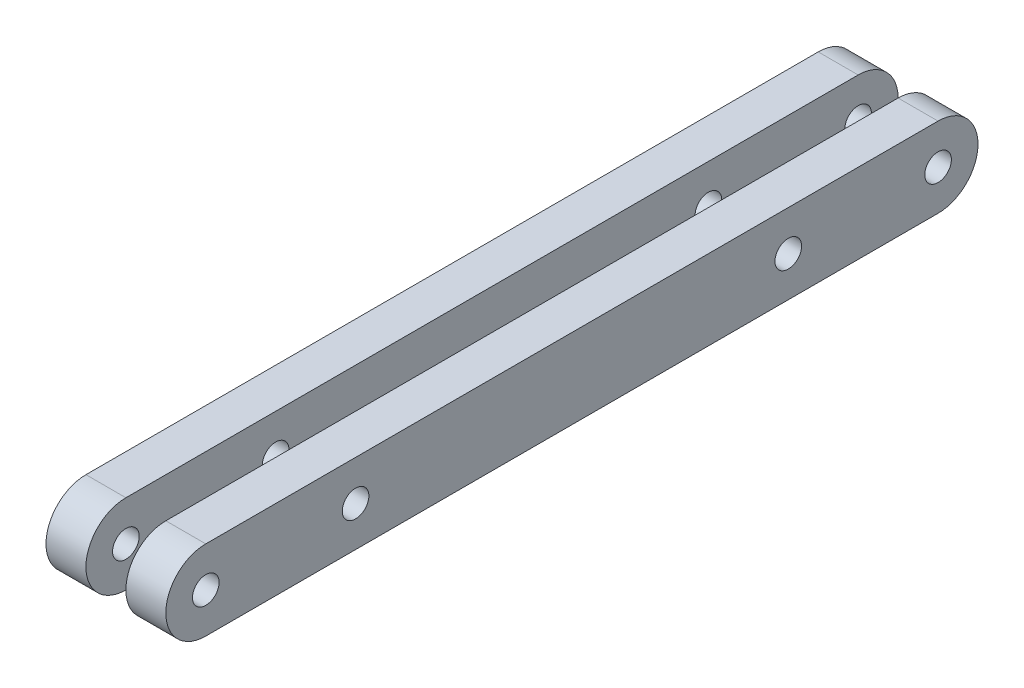
ISO-10303-21;
HEADER;
FILE_DESCRIPTION(('STEP AP214'),'2;1');
FILE_NAME('part.step','',(''),(''),'','','');
FILE_SCHEMA(('AUTOMOTIVE_DESIGN { 1 0 10303 214 1 1 1 1 }'));
ENDSEC;
DATA;
#1=APPLICATION_CONTEXT('core data for automotive mechanical design processes');
#2=APPLICATION_PROTOCOL_DEFINITION('international standard','automotive_design',2000,#1);
#3=PRODUCT_CONTEXT('',#1,'mechanical');
#4=PRODUCT('Part','Part','',(#3));
#5=PRODUCT_RELATED_PRODUCT_CATEGORY('part','',(#4));
#6=PRODUCT_DEFINITION_FORMATION('','',#4);
#7=PRODUCT_DEFINITION_CONTEXT('part definition',#1,'design');
#8=PRODUCT_DEFINITION('design','',#6,#7);
#9=PRODUCT_DEFINITION_SHAPE('','',#8);
#10=(LENGTH_UNIT() NAMED_UNIT(*) SI_UNIT(.MILLI.,.METRE.));
#11=(NAMED_UNIT(*) PLANE_ANGLE_UNIT() SI_UNIT($,.RADIAN.));
#12=(NAMED_UNIT(*) SI_UNIT($,.STERADIAN.) SOLID_ANGLE_UNIT());
#13=UNCERTAINTY_MEASURE_WITH_UNIT(LENGTH_MEASURE(1.E-05),#10,'distance_accuracy_value','');
#14=(GEOMETRIC_REPRESENTATION_CONTEXT(3) GLOBAL_UNCERTAINTY_ASSIGNED_CONTEXT((#13)) GLOBAL_UNIT_ASSIGNED_CONTEXT((#10,
#11,#12)) REPRESENTATION_CONTEXT('',''));
#15=CARTESIAN_POINT('',(0.,0.,0.));
#16=DIRECTION('',(0.,0.,1.));
#17=DIRECTION('',(1.,0.,0.));
#18=AXIS2_PLACEMENT_3D('',#15,#16,#17);
#19=CARTESIAN_POINT('',(-9.,0.,0.));
#20=DIRECTION('',(1.,0.,0.));
#21=DIRECTION('',(0.,0.,1.));
#22=AXIS2_PLACEMENT_3D('',#19,#20,#21);
#23=CYLINDRICAL_SURFACE('',#22,6.);
#24=CARTESIAN_POINT('',(-3.,0.,0.));
#25=DIRECTION('',(1.,0.,0.));
#26=DIRECTION('',(0.,0.,-1.));
#27=AXIS2_PLACEMENT_3D('',#24,#25,#26);
#28=CIRCLE('',#27,6.);
#29=CARTESIAN_POINT('',(-3.,6.,0.));
#30=VERTEX_POINT('',#29);
#31=CARTESIAN_POINT('',(-3.,-6.,0.));
#32=VERTEX_POINT('',#31);
#33=EDGE_CURVE('E113',#30,#32,#28,.T.);
#34=ORIENTED_EDGE('',*,*,#33,.F.);
#35=DIRECTION('',(1.,0.,0.));
#36=VECTOR('',#35,1.);
#37=CARTESIAN_POINT('',(-9.,6.,0.));
#38=LINE('',#37,#36);
#39=CARTESIAN_POINT('',(-9.,6.,0.));
#40=VERTEX_POINT('',#39);
#41=EDGE_CURVE('E112',#40,#30,#38,.T.);
#42=ORIENTED_EDGE('',*,*,#41,.F.);
#43=CARTESIAN_POINT('',(-9.,0.,0.));
#44=DIRECTION('',(1.,0.,0.));
#45=DIRECTION('',(0.,0.,-1.));
#46=AXIS2_PLACEMENT_3D('',#43,#44,#45);
#47=CIRCLE('',#46,6.);
#48=CARTESIAN_POINT('',(-9.,-6.,0.));
#49=VERTEX_POINT('',#48);
#50=EDGE_CURVE('E106',#40,#49,#47,.T.);
#51=ORIENTED_EDGE('',*,*,#50,.T.);
#52=DIRECTION('',(1.,0.,0.));
#53=VECTOR('',#52,1.);
#54=CARTESIAN_POINT('',(-9.,-6.,0.));
#55=LINE('',#54,#53);
#56=EDGE_CURVE('E12',#49,#32,#55,.T.);
#57=ORIENTED_EDGE('',*,*,#56,.T.);
#58=EDGE_LOOP('',(#34,#42,#51,#57));
#59=FACE_BOUND('',#58,.T.);
#60=ADVANCED_FACE('F49',(#59),#23,.T.);
#61=CARTESIAN_POINT('',(-9.,-6.,0.));
#62=DIRECTION('',(0.,1.,0.));
#63=DIRECTION('',(0.,0.,1.));
#64=AXIS2_PLACEMENT_3D('',#61,#62,#63);
#65=PLANE('',#64);
#66=DIRECTION('',(0.,0.,-1.));
#67=VECTOR('',#66,1.);
#68=CARTESIAN_POINT('',(-3.,-6.,0.));
#69=LINE('',#68,#67);
#70=CARTESIAN_POINT('',(-3.,-6.,-110.));
#71=VERTEX_POINT('',#70);
#72=EDGE_CURVE('E115',#32,#71,#69,.T.);
#73=ORIENTED_EDGE('',*,*,#72,.F.);
#74=ORIENTED_EDGE('',*,*,#56,.F.);
#75=DIRECTION('',(0.,0.,-1.));
#76=VECTOR('',#75,1.);
#77=CARTESIAN_POINT('',(-9.,-6.,0.));
#78=LINE('',#77,#76);
#79=CARTESIAN_POINT('',(-9.,-6.,-110.));
#80=VERTEX_POINT('',#79);
#81=EDGE_CURVE('E90',#49,#80,#78,.T.);
#82=ORIENTED_EDGE('',*,*,#81,.T.);
#83=DIRECTION('',(1.,0.,0.));
#84=VECTOR('',#83,1.);
#85=CARTESIAN_POINT('',(-9.,-6.,-110.));
#86=LINE('',#85,#84);
#87=EDGE_CURVE('E57',#80,#71,#86,.T.);
#88=ORIENTED_EDGE('',*,*,#87,.T.);
#89=EDGE_LOOP('',(#73,#74,#82,#88));
#90=FACE_BOUND('',#89,.T.);
#91=ADVANCED_FACE('F104',(#90),#65,.F.);
#92=CARTESIAN_POINT('',(-9.,0.,-110.));
#93=DIRECTION('',(1.,0.,0.));
#94=DIRECTION('',(0.,0.,1.));
#95=AXIS2_PLACEMENT_3D('',#92,#93,#94);
#96=CYLINDRICAL_SURFACE('',#95,6.);
#97=CARTESIAN_POINT('',(-3.,0.,-110.));
#98=DIRECTION('',(1.,0.,0.));
#99=DIRECTION('',(0.,0.,-1.));
#100=AXIS2_PLACEMENT_3D('',#97,#98,#99);
#101=CIRCLE('',#100,6.);
#102=CARTESIAN_POINT('',(-3.,6.,-110.));
#103=VERTEX_POINT('',#102);
#104=EDGE_CURVE('E100',#71,#103,#101,.T.);
#105=ORIENTED_EDGE('',*,*,#104,.F.);
#106=ORIENTED_EDGE('',*,*,#87,.F.);
#107=CARTESIAN_POINT('',(-9.,0.,-110.));
#108=DIRECTION('',(1.,0.,0.));
#109=DIRECTION('',(0.,0.,-1.));
#110=AXIS2_PLACEMENT_3D('',#107,#108,#109);
#111=CIRCLE('',#110,6.);
#112=CARTESIAN_POINT('',(-9.,6.,-110.));
#113=VERTEX_POINT('',#112);
#114=EDGE_CURVE('E93',#80,#113,#111,.T.);
#115=ORIENTED_EDGE('',*,*,#114,.T.);
#116=DIRECTION('',(1.,0.,0.));
#117=VECTOR('',#116,1.);
#118=CARTESIAN_POINT('',(-9.,6.,-110.));
#119=LINE('',#118,#117);
#120=EDGE_CURVE('E103',#113,#103,#119,.T.);
#121=ORIENTED_EDGE('',*,*,#120,.T.);
#122=EDGE_LOOP('',(#105,#106,#115,#121));
#123=FACE_BOUND('',#122,.T.);
#124=ADVANCED_FACE('F99',(#123),#96,.T.);
#125=CARTESIAN_POINT('',(-9.,6.,0.));
#126=DIRECTION('',(0.,1.,0.));
#127=DIRECTION('',(0.,0.,1.));
#128=AXIS2_PLACEMENT_3D('',#125,#126,#127);
#129=PLANE('',#128);
#130=DIRECTION('',(0.,0.,-1.));
#131=VECTOR('',#130,1.);
#132=CARTESIAN_POINT('',(-3.,6.,0.));
#133=LINE('',#132,#131);
#134=EDGE_CURVE('E79',#30,#103,#133,.T.);
#135=ORIENTED_EDGE('',*,*,#134,.T.);
#136=ORIENTED_EDGE('',*,*,#120,.F.);
#137=DIRECTION('',(0.,0.,-1.));
#138=VECTOR('',#137,1.);
#139=CARTESIAN_POINT('',(-9.,6.,0.));
#140=LINE('',#139,#138);
#141=EDGE_CURVE('E65',#40,#113,#140,.T.);
#142=ORIENTED_EDGE('',*,*,#141,.F.);
#143=ORIENTED_EDGE('',*,*,#41,.T.);
#144=EDGE_LOOP('',(#135,#136,#142,#143));
#145=FACE_BOUND('',#144,.T.);
#146=ADVANCED_FACE('F125',(#145),#129,.T.);
#147=CARTESIAN_POINT('',(-9.,0.,0.));
#148=DIRECTION('',(-1.,0.,0.));
#149=DIRECTION('',(0.,0.,-1.));
#150=AXIS2_PLACEMENT_3D('',#147,#148,#149);
#151=PLANE('',#150);
#152=CARTESIAN_POINT('',(-9.,0.,-87.5));
#153=DIRECTION('',(1.,0.,0.));
#154=DIRECTION('',(0.,0.,-1.));
#155=AXIS2_PLACEMENT_3D('',#152,#153,#154);
#156=CIRCLE('',#155,2.);
#157=CARTESIAN_POINT('',(-9.,0.,-89.5));
#158=VERTEX_POINT('',#157);
#159=EDGE_CURVE('E213',#158,#158,#156,.T.);
#160=ORIENTED_EDGE('',*,*,#159,.T.);
#161=EDGE_LOOP('',(#160));
#162=FACE_BOUND('',#161,.T.);
#163=CARTESIAN_POINT('',(-9.,0.,-22.5));
#164=DIRECTION('',(1.,0.,0.));
#165=DIRECTION('',(0.,0.,-1.));
#166=AXIS2_PLACEMENT_3D('',#163,#164,#165);
#167=CIRCLE('',#166,2.);
#168=CARTESIAN_POINT('',(-9.,0.,-24.5));
#169=VERTEX_POINT('',#168);
#170=EDGE_CURVE('E217',#169,#169,#167,.T.);
#171=ORIENTED_EDGE('',*,*,#170,.T.);
#172=EDGE_LOOP('',(#171));
#173=FACE_BOUND('',#172,.T.);
#174=CARTESIAN_POINT('',(-9.,0.,0.));
#175=DIRECTION('',(1.,0.,0.));
#176=DIRECTION('',(0.,0.,-1.));
#177=AXIS2_PLACEMENT_3D('',#174,#175,#176);
#178=CIRCLE('',#177,2.00000000000001);
#179=CARTESIAN_POINT('',(-9.,0.,-2.00000000000001));
#180=VERTEX_POINT('',#179);
#181=EDGE_CURVE('E116',#180,#180,#178,.T.);
#182=ORIENTED_EDGE('',*,*,#181,.T.);
#183=EDGE_LOOP('',(#182));
#184=FACE_BOUND('',#183,.T.);
#185=CARTESIAN_POINT('',(-9.,0.,-110.));
#186=DIRECTION('',(1.,0.,0.));
#187=DIRECTION('',(0.,0.,-1.));
#188=AXIS2_PLACEMENT_3D('',#185,#186,#187);
#189=CIRCLE('',#188,2.);
#190=CARTESIAN_POINT('',(-9.,0.,-112.));
#191=VERTEX_POINT('',#190);
#192=EDGE_CURVE('E230',#191,#191,#189,.T.);
#193=ORIENTED_EDGE('',*,*,#192,.T.);
#194=EDGE_LOOP('',(#193));
#195=FACE_BOUND('',#194,.T.);
#196=ORIENTED_EDGE('',*,*,#50,.F.);
#197=ORIENTED_EDGE('',*,*,#141,.T.);
#198=ORIENTED_EDGE('',*,*,#114,.F.);
#199=ORIENTED_EDGE('',*,*,#81,.F.);
#200=EDGE_LOOP('',(#196,#197,#198,#199));
#201=FACE_BOUND('',#200,.T.);
#202=ADVANCED_FACE('F95',(#162,#173,#184,#195,#201),#151,.T.);
#203=CARTESIAN_POINT('',(-3.,0.,0.));
#204=DIRECTION('',(-1.,0.,0.));
#205=DIRECTION('',(0.,0.,-1.));
#206=AXIS2_PLACEMENT_3D('',#203,#204,#205);
#207=PLANE('',#206);
#208=CARTESIAN_POINT('',(-3.,0.,-87.5));
#209=DIRECTION('',(-1.,0.,0.));
#210=DIRECTION('',(0.,0.,1.));
#211=AXIS2_PLACEMENT_3D('',#208,#209,#210);
#212=CIRCLE('',#211,2.);
#213=CARTESIAN_POINT('',(-3.,0.,-85.5));
#214=VERTEX_POINT('',#213);
#215=EDGE_CURVE('E216',#214,#214,#212,.T.);
#216=ORIENTED_EDGE('',*,*,#215,.T.);
#217=EDGE_LOOP('',(#216));
#218=FACE_BOUND('',#217,.T.);
#219=CARTESIAN_POINT('',(-3.,0.,-22.5));
#220=DIRECTION('',(-1.,0.,0.));
#221=DIRECTION('',(0.,0.,1.));
#222=AXIS2_PLACEMENT_3D('',#219,#220,#221);
#223=CIRCLE('',#222,2.);
#224=CARTESIAN_POINT('',(-3.,0.,-20.5));
#225=VERTEX_POINT('',#224);
#226=EDGE_CURVE('E220',#225,#225,#223,.T.);
#227=ORIENTED_EDGE('',*,*,#226,.T.);
#228=EDGE_LOOP('',(#227));
#229=FACE_BOUND('',#228,.T.);
#230=CARTESIAN_POINT('',(-3.,0.,0.));
#231=DIRECTION('',(1.,0.,0.));
#232=DIRECTION('',(0.,0.,-1.));
#233=AXIS2_PLACEMENT_3D('',#230,#231,#232);
#234=CIRCLE('',#233,2.00000000000001);
#235=CARTESIAN_POINT('',(-3.,0.,-2.00000000000001));
#236=VERTEX_POINT('',#235);
#237=EDGE_CURVE('E227',#236,#236,#234,.T.);
#238=ORIENTED_EDGE('',*,*,#237,.F.);
#239=EDGE_LOOP('',(#238));
#240=FACE_BOUND('',#239,.T.);
#241=CARTESIAN_POINT('',(-3.,0.,-110.));
#242=DIRECTION('',(1.,0.,0.));
#243=DIRECTION('',(0.,0.,-1.));
#244=AXIS2_PLACEMENT_3D('',#241,#242,#243);
#245=CIRCLE('',#244,2.);
#246=CARTESIAN_POINT('',(-3.,0.,-112.));
#247=VERTEX_POINT('',#246);
#248=EDGE_CURVE('E226',#247,#247,#245,.T.);
#249=ORIENTED_EDGE('',*,*,#248,.F.);
#250=EDGE_LOOP('',(#249));
#251=FACE_BOUND('',#250,.T.);
#252=ORIENTED_EDGE('',*,*,#33,.T.);
#253=ORIENTED_EDGE('',*,*,#72,.T.);
#254=ORIENTED_EDGE('',*,*,#104,.T.);
#255=ORIENTED_EDGE('',*,*,#134,.F.);
#256=EDGE_LOOP('',(#252,#253,#254,#255));
#257=FACE_BOUND('',#256,.T.);
#258=ADVANCED_FACE('F121',(#218,#229,#240,#251,#257),#207,.F.);
#259=CARTESIAN_POINT('',(-3.,0.,-110.));
#260=DIRECTION('',(-1.,0.,0.));
#261=DIRECTION('',(0.,0.,-1.));
#262=AXIS2_PLACEMENT_3D('',#259,#260,#261);
#263=CYLINDRICAL_SURFACE('',#262,2.);
#264=ORIENTED_EDGE('',*,*,#192,.F.);
#265=EDGE_LOOP('',(#264));
#266=FACE_BOUND('',#265,.T.);
#267=ORIENTED_EDGE('',*,*,#248,.T.);
#268=EDGE_LOOP('',(#267));
#269=FACE_BOUND('',#268,.T.);
#270=ADVANCED_FACE('F169',(#266,#269),#263,.F.);
#271=CARTESIAN_POINT('',(-3.,0.,0.));
#272=DIRECTION('',(-1.,0.,0.));
#273=DIRECTION('',(0.,0.,-1.));
#274=AXIS2_PLACEMENT_3D('',#271,#272,#273);
#275=CYLINDRICAL_SURFACE('',#274,2.00000000000001);
#276=ORIENTED_EDGE('',*,*,#181,.F.);
#277=EDGE_LOOP('',(#276));
#278=FACE_BOUND('',#277,.T.);
#279=ORIENTED_EDGE('',*,*,#237,.T.);
#280=EDGE_LOOP('',(#279));
#281=FACE_BOUND('',#280,.T.);
#282=ADVANCED_FACE('F179',(#278,#281),#275,.F.);
#283=CARTESIAN_POINT('',(9.,0.,-22.5));
#284=DIRECTION('',(1.,0.,0.));
#285=DIRECTION('',(0.,0.,-1.));
#286=AXIS2_PLACEMENT_3D('',#283,#284,#285);
#287=CYLINDRICAL_SURFACE('',#286,2.);
#288=ORIENTED_EDGE('',*,*,#170,.F.);
#289=EDGE_LOOP('',(#288));
#290=FACE_BOUND('',#289,.T.);
#291=ORIENTED_EDGE('',*,*,#226,.F.);
#292=EDGE_LOOP('',(#291));
#293=FACE_BOUND('',#292,.T.);
#294=ADVANCED_FACE('F189',(#290,#293),#287,.F.);
#295=CARTESIAN_POINT('',(9.,0.,-87.5));
#296=DIRECTION('',(1.,0.,0.));
#297=DIRECTION('',(0.,0.,-1.));
#298=AXIS2_PLACEMENT_3D('',#295,#296,#297);
#299=CYLINDRICAL_SURFACE('',#298,2.);
#300=ORIENTED_EDGE('',*,*,#159,.F.);
#301=EDGE_LOOP('',(#300));
#302=FACE_BOUND('',#301,.T.);
#303=ORIENTED_EDGE('',*,*,#215,.F.);
#304=EDGE_LOOP('',(#303));
#305=FACE_BOUND('',#304,.T.);
#306=ADVANCED_FACE('F197',(#302,#305),#299,.F.);
#307=CLOSED_SHELL('',(#60,#91,#124,#146,#202,#258,#270,#282,#294,#306));
#308=MANIFOLD_SOLID_BREP('B2',#307);
#309=CARTESIAN_POINT('',(9.,0.,0.));
#310=DIRECTION('',(-1.,0.,0.));
#311=DIRECTION('',(0.,0.,1.));
#312=AXIS2_PLACEMENT_3D('',#309,#310,#311);
#313=CYLINDRICAL_SURFACE('',#312,6.);
#314=CARTESIAN_POINT('',(3.,0.,0.));
#315=DIRECTION('',(1.,0.,0.));
#316=DIRECTION('',(0.,0.,-1.));
#317=AXIS2_PLACEMENT_3D('',#314,#315,#316);
#318=CIRCLE('',#317,6.);
#319=CARTESIAN_POINT('',(3.,6.,0.));
#320=VERTEX_POINT('',#319);
#321=CARTESIAN_POINT('',(3.,-6.,0.));
#322=VERTEX_POINT('',#321);
#323=EDGE_CURVE('E322',#320,#322,#318,.T.);
#324=ORIENTED_EDGE('',*,*,#323,.T.);
#325=DIRECTION('',(-1.,0.,0.));
#326=VECTOR('',#325,1.);
#327=CARTESIAN_POINT('',(9.,-6.,0.));
#328=LINE('',#327,#326);
#329=CARTESIAN_POINT('',(9.,-6.,0.));
#330=VERTEX_POINT('',#329);
#331=EDGE_CURVE('E47',#330,#322,#328,.T.);
#332=ORIENTED_EDGE('',*,*,#331,.F.);
#333=CARTESIAN_POINT('',(9.,0.,0.));
#334=DIRECTION('',(1.,0.,0.));
#335=DIRECTION('',(0.,0.,-1.));
#336=AXIS2_PLACEMENT_3D('',#333,#334,#335);
#337=CIRCLE('',#336,6.);
#338=CARTESIAN_POINT('',(9.,6.,0.));
#339=VERTEX_POINT('',#338);
#340=EDGE_CURVE('E307',#339,#330,#337,.T.);
#341=ORIENTED_EDGE('',*,*,#340,.F.);
#342=DIRECTION('',(-1.,0.,0.));
#343=VECTOR('',#342,1.);
#344=CARTESIAN_POINT('',(9.,6.,0.));
#345=LINE('',#344,#343);
#346=EDGE_CURVE('E274',#339,#320,#345,.T.);
#347=ORIENTED_EDGE('',*,*,#346,.T.);
#348=EDGE_LOOP('',(#324,#332,#341,#347));
#349=FACE_BOUND('',#348,.T.);
#350=ADVANCED_FACE('F257',(#349),#313,.T.);
#351=CARTESIAN_POINT('',(9.,-6.,0.));
#352=DIRECTION('',(0.,1.,0.));
#353=DIRECTION('',(0.,0.,1.));
#354=AXIS2_PLACEMENT_3D('',#351,#352,#353);
#355=PLANE('',#354);
#356=DIRECTION('',(0.,0.,-1.));
#357=VECTOR('',#356,1.);
#358=CARTESIAN_POINT('',(3.,-6.,0.));
#359=LINE('',#358,#357);
#360=CARTESIAN_POINT('',(3.,-6.,-110.));
#361=VERTEX_POINT('',#360);
#362=EDGE_CURVE('E312',#322,#361,#359,.T.);
#363=ORIENTED_EDGE('',*,*,#362,.T.);
#364=DIRECTION('',(-1.,0.,0.));
#365=VECTOR('',#364,1.);
#366=CARTESIAN_POINT('',(9.,-6.,-110.));
#367=LINE('',#366,#365);
#368=CARTESIAN_POINT('',(9.,-6.,-110.));
#369=VERTEX_POINT('',#368);
#370=EDGE_CURVE('E266',#369,#361,#367,.T.);
#371=ORIENTED_EDGE('',*,*,#370,.F.);
#372=DIRECTION('',(0.,0.,-1.));
#373=VECTOR('',#372,1.);
#374=CARTESIAN_POINT('',(9.,-6.,0.));
#375=LINE('',#374,#373);
#376=EDGE_CURVE('E300',#330,#369,#375,.T.);
#377=ORIENTED_EDGE('',*,*,#376,.F.);
#378=ORIENTED_EDGE('',*,*,#331,.T.);
#379=EDGE_LOOP('',(#363,#371,#377,#378));
#380=FACE_BOUND('',#379,.T.);
#381=ADVANCED_FACE('F311',(#380),#355,.F.);
#382=CARTESIAN_POINT('',(9.,0.,-110.));
#383=DIRECTION('',(-1.,0.,0.));
#384=DIRECTION('',(0.,0.,1.));
#385=AXIS2_PLACEMENT_3D('',#382,#383,#384);
#386=CYLINDRICAL_SURFACE('',#385,6.);
#387=CARTESIAN_POINT('',(3.,0.,-110.));
#388=DIRECTION('',(1.,0.,0.));
#389=DIRECTION('',(0.,0.,-1.));
#390=AXIS2_PLACEMENT_3D('',#387,#388,#389);
#391=CIRCLE('',#390,6.);
#392=CARTESIAN_POINT('',(3.,6.,-110.));
#393=VERTEX_POINT('',#392);
#394=EDGE_CURVE('E326',#361,#393,#391,.T.);
#395=ORIENTED_EDGE('',*,*,#394,.T.);
#396=DIRECTION('',(-1.,0.,0.));
#397=VECTOR('',#396,1.);
#398=CARTESIAN_POINT('',(9.,6.,-110.));
#399=LINE('',#398,#397);
#400=CARTESIAN_POINT('',(9.,6.,-110.));
#401=VERTEX_POINT('',#400);
#402=EDGE_CURVE('E289',#401,#393,#399,.T.);
#403=ORIENTED_EDGE('',*,*,#402,.F.);
#404=CARTESIAN_POINT('',(9.,0.,-110.));
#405=DIRECTION('',(1.,0.,0.));
#406=DIRECTION('',(0.,0.,-1.));
#407=AXIS2_PLACEMENT_3D('',#404,#405,#406);
#408=CIRCLE('',#407,6.);
#409=EDGE_CURVE('E306',#369,#401,#408,.T.);
#410=ORIENTED_EDGE('',*,*,#409,.F.);
#411=ORIENTED_EDGE('',*,*,#370,.T.);
#412=EDGE_LOOP('',(#395,#403,#410,#411));
#413=FACE_BOUND('',#412,.T.);
#414=ADVANCED_FACE('F316',(#413),#386,.T.);
#415=CARTESIAN_POINT('',(9.,6.,0.));
#416=DIRECTION('',(0.,1.,0.));
#417=DIRECTION('',(0.,0.,1.));
#418=AXIS2_PLACEMENT_3D('',#415,#416,#417);
#419=PLANE('',#418);
#420=DIRECTION('',(0.,0.,-1.));
#421=VECTOR('',#420,1.);
#422=CARTESIAN_POINT('',(3.,6.,0.));
#423=LINE('',#422,#421);
#424=EDGE_CURVE('E328',#320,#393,#423,.T.);
#425=ORIENTED_EDGE('',*,*,#424,.F.);
#426=ORIENTED_EDGE('',*,*,#346,.F.);
#427=DIRECTION('',(0.,0.,-1.));
#428=VECTOR('',#427,1.);
#429=CARTESIAN_POINT('',(9.,6.,0.));
#430=LINE('',#429,#428);
#431=EDGE_CURVE('E317',#339,#401,#430,.T.);
#432=ORIENTED_EDGE('',*,*,#431,.T.);
#433=ORIENTED_EDGE('',*,*,#402,.T.);
#434=EDGE_LOOP('',(#425,#426,#432,#433));
#435=FACE_BOUND('',#434,.T.);
#436=ADVANCED_FACE('F361',(#435),#419,.T.);
#437=CARTESIAN_POINT('',(9.,0.,0.));
#438=DIRECTION('',(1.,0.,0.));
#439=DIRECTION('',(0.,0.,-1.));
#440=AXIS2_PLACEMENT_3D('',#437,#438,#439);
#441=PLANE('',#440);
#442=CARTESIAN_POINT('',(9.,0.,-87.5));
#443=DIRECTION('',(1.,0.,0.));
#444=DIRECTION('',(0.,0.,-1.));
#445=AXIS2_PLACEMENT_3D('',#442,#443,#444);
#446=CIRCLE('',#445,2.);
#447=CARTESIAN_POINT('',(9.,0.,-89.5));
#448=VERTEX_POINT('',#447);
#449=EDGE_CURVE('E351',#448,#448,#446,.T.);
#450=ORIENTED_EDGE('',*,*,#449,.F.);
#451=EDGE_LOOP('',(#450));
#452=FACE_BOUND('',#451,.T.);
#453=CARTESIAN_POINT('',(9.,0.,-22.5));
#454=DIRECTION('',(1.,0.,0.));
#455=DIRECTION('',(0.,0.,-1.));
#456=AXIS2_PLACEMENT_3D('',#453,#454,#455);
#457=CIRCLE('',#456,2.);
#458=CARTESIAN_POINT('',(9.,0.,-24.5));
#459=VERTEX_POINT('',#458);
#460=EDGE_CURVE('E345',#459,#459,#457,.T.);
#461=ORIENTED_EDGE('',*,*,#460,.F.);
#462=EDGE_LOOP('',(#461));
#463=FACE_BOUND('',#462,.T.);
#464=CARTESIAN_POINT('',(9.,0.,0.));
#465=DIRECTION('',(1.,0.,0.));
#466=DIRECTION('',(0.,0.,-1.));
#467=AXIS2_PLACEMENT_3D('',#464,#465,#466);
#468=CIRCLE('',#467,2.00000000000001);
#469=CARTESIAN_POINT('',(9.,0.,-2.00000000000001));
#470=VERTEX_POINT('',#469);
#471=EDGE_CURVE('E324',#470,#470,#468,.T.);
#472=ORIENTED_EDGE('',*,*,#471,.F.);
#473=EDGE_LOOP('',(#472));
#474=FACE_BOUND('',#473,.T.);
#475=CARTESIAN_POINT('',(9.,0.,-110.));
#476=DIRECTION('',(1.,0.,0.));
#477=DIRECTION('',(0.,0.,-1.));
#478=AXIS2_PLACEMENT_3D('',#475,#476,#477);
#479=CIRCLE('',#478,2.);
#480=CARTESIAN_POINT('',(9.,0.,-112.));
#481=VERTEX_POINT('',#480);
#482=EDGE_CURVE('E336',#481,#481,#479,.T.);
#483=ORIENTED_EDGE('',*,*,#482,.F.);
#484=EDGE_LOOP('',(#483));
#485=FACE_BOUND('',#484,.T.);
#486=ORIENTED_EDGE('',*,*,#340,.T.);
#487=ORIENTED_EDGE('',*,*,#376,.T.);
#488=ORIENTED_EDGE('',*,*,#409,.T.);
#489=ORIENTED_EDGE('',*,*,#431,.F.);
#490=EDGE_LOOP('',(#486,#487,#488,#489));
#491=FACE_BOUND('',#490,.T.);
#492=ADVANCED_FACE('F303',(#452,#463,#474,#485,#491),#441,.T.);
#493=CARTESIAN_POINT('',(3.,0.,0.));
#494=DIRECTION('',(1.,0.,0.));
#495=DIRECTION('',(0.,0.,-1.));
#496=AXIS2_PLACEMENT_3D('',#493,#494,#495);
#497=PLANE('',#496);
#498=CARTESIAN_POINT('',(3.,0.,-87.5));
#499=DIRECTION('',(1.,0.,0.));
#500=DIRECTION('',(0.,0.,-1.));
#501=AXIS2_PLACEMENT_3D('',#498,#499,#500);
#502=CIRCLE('',#501,2.);
#503=CARTESIAN_POINT('',(3.,0.,-89.5));
#504=VERTEX_POINT('',#503);
#505=EDGE_CURVE('E348',#504,#504,#502,.T.);
#506=ORIENTED_EDGE('',*,*,#505,.T.);
#507=EDGE_LOOP('',(#506));
#508=FACE_BOUND('',#507,.T.);
#509=CARTESIAN_POINT('',(3.,0.,-22.5));
#510=DIRECTION('',(1.,0.,0.));
#511=DIRECTION('',(0.,0.,-1.));
#512=AXIS2_PLACEMENT_3D('',#509,#510,#511);
#513=CIRCLE('',#512,2.);
#514=CARTESIAN_POINT('',(3.,0.,-24.5));
#515=VERTEX_POINT('',#514);
#516=EDGE_CURVE('E260',#515,#515,#513,.T.);
#517=ORIENTED_EDGE('',*,*,#516,.T.);
#518=EDGE_LOOP('',(#517));
#519=FACE_BOUND('',#518,.T.);
#520=CARTESIAN_POINT('',(3.,0.,0.));
#521=DIRECTION('',(1.,0.,0.));
#522=DIRECTION('',(0.,0.,-1.));
#523=AXIS2_PLACEMENT_3D('',#520,#521,#522);
#524=CIRCLE('',#523,2.00000000000001);
#525=CARTESIAN_POINT('',(3.,0.,-2.00000000000001));
#526=VERTEX_POINT('',#525);
#527=EDGE_CURVE('E339',#526,#526,#524,.T.);
#528=ORIENTED_EDGE('',*,*,#527,.T.);
#529=EDGE_LOOP('',(#528));
#530=FACE_BOUND('',#529,.T.);
#531=CARTESIAN_POINT('',(3.,0.,-110.));
#532=DIRECTION('',(1.,0.,0.));
#533=DIRECTION('',(0.,0.,-1.));
#534=AXIS2_PLACEMENT_3D('',#531,#532,#533);
#535=CIRCLE('',#534,2.);
#536=CARTESIAN_POINT('',(3.,0.,-112.));
#537=VERTEX_POINT('',#536);
#538=EDGE_CURVE('E340',#537,#537,#535,.T.);
#539=ORIENTED_EDGE('',*,*,#538,.T.);
#540=EDGE_LOOP('',(#539));
#541=FACE_BOUND('',#540,.T.);
#542=ORIENTED_EDGE('',*,*,#323,.F.);
#543=ORIENTED_EDGE('',*,*,#424,.T.);
#544=ORIENTED_EDGE('',*,*,#394,.F.);
#545=ORIENTED_EDGE('',*,*,#362,.F.);
#546=EDGE_LOOP('',(#542,#543,#544,#545));
#547=FACE_BOUND('',#546,.T.);
#548=ADVANCED_FACE('F360',(#508,#519,#530,#541,#547),#497,.F.);
#549=CARTESIAN_POINT('',(3.,0.,-110.));
#550=DIRECTION('',(1.,0.,0.));
#551=DIRECTION('',(0.,0.,-1.));
#552=AXIS2_PLACEMENT_3D('',#549,#550,#551);
#553=CYLINDRICAL_SURFACE('',#552,2.);
#554=ORIENTED_EDGE('',*,*,#482,.T.);
#555=EDGE_LOOP('',(#554));
#556=FACE_BOUND('',#555,.T.);
#557=ORIENTED_EDGE('',*,*,#538,.F.);
#558=EDGE_LOOP('',(#557));
#559=FACE_BOUND('',#558,.T.);
#560=ADVANCED_FACE('F369',(#556,#559),#553,.F.);
#561=CARTESIAN_POINT('',(3.,0.,0.));
#562=DIRECTION('',(1.,0.,0.));
#563=DIRECTION('',(0.,0.,-1.));
#564=AXIS2_PLACEMENT_3D('',#561,#562,#563);
#565=CYLINDRICAL_SURFACE('',#564,2.00000000000001);
#566=ORIENTED_EDGE('',*,*,#471,.T.);
#567=EDGE_LOOP('',(#566));
#568=FACE_BOUND('',#567,.T.);
#569=ORIENTED_EDGE('',*,*,#527,.F.);
#570=EDGE_LOOP('',(#569));
#571=FACE_BOUND('',#570,.T.);
#572=ADVANCED_FACE('F372',(#568,#571),#565,.F.);
#573=CARTESIAN_POINT('',(9.,0.,-22.5));
#574=DIRECTION('',(1.,0.,0.));
#575=DIRECTION('',(0.,0.,-1.));
#576=AXIS2_PLACEMENT_3D('',#573,#574,#575);
#577=CYLINDRICAL_SURFACE('',#576,2.);
#578=ORIENTED_EDGE('',*,*,#460,.T.);
#579=EDGE_LOOP('',(#578));
#580=FACE_BOUND('',#579,.T.);
#581=ORIENTED_EDGE('',*,*,#516,.F.);
#582=EDGE_LOOP('',(#581));
#583=FACE_BOUND('',#582,.T.);
#584=ADVANCED_FACE('F429',(#580,#583),#577,.F.);
#585=CARTESIAN_POINT('',(9.,0.,-87.5));
#586=DIRECTION('',(1.,0.,0.));
#587=DIRECTION('',(0.,0.,-1.));
#588=AXIS2_PLACEMENT_3D('',#585,#586,#587);
#589=CYLINDRICAL_SURFACE('',#588,2.);
#590=ORIENTED_EDGE('',*,*,#449,.T.);
#591=EDGE_LOOP('',(#590));
#592=FACE_BOUND('',#591,.T.);
#593=ORIENTED_EDGE('',*,*,#505,.F.);
#594=EDGE_LOOP('',(#593));
#595=FACE_BOUND('',#594,.T.);
#596=ADVANCED_FACE('F355',(#592,#595),#589,.F.);
#597=CLOSED_SHELL('',(#350,#381,#414,#436,#492,#548,#560,#572,#584,#596));
#598=MANIFOLD_SOLID_BREP('B6',#597);
#599=ADVANCED_BREP_SHAPE_REPRESENTATION('',(#18,#308,#598),#14);
#600=SHAPE_DEFINITION_REPRESENTATION(#9,#599);
ENDSEC;
END-ISO-10303-21;
